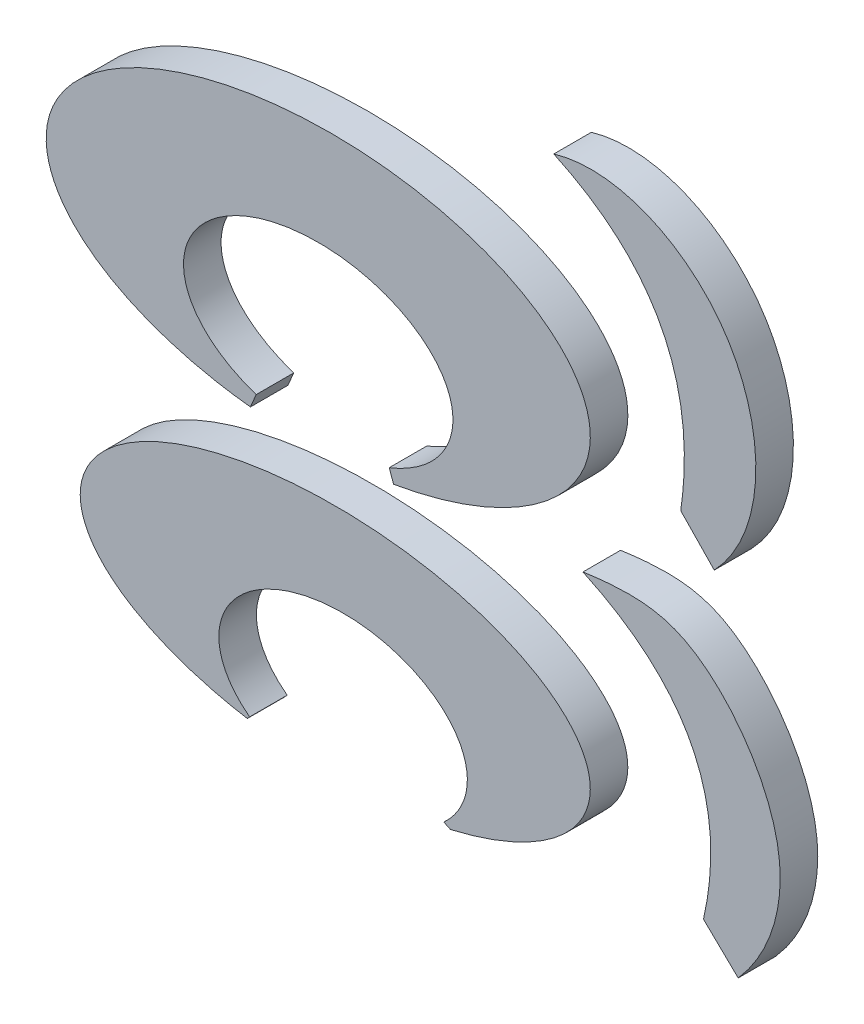
ISO-10303-21;
HEADER;
FILE_DESCRIPTION(('STEP AP214'),'2;1');
FILE_NAME('part.step','',(''),(''),'','','');
FILE_SCHEMA(('AUTOMOTIVE_DESIGN { 1 0 10303 214 1 1 1 1 }'));
ENDSEC;
DATA;
#1=APPLICATION_CONTEXT('core data for automotive mechanical design processes');
#2=APPLICATION_PROTOCOL_DEFINITION('international standard','automotive_design',2000,#1);
#3=PRODUCT_CONTEXT('',#1,'mechanical');
#4=PRODUCT('Part','Part','',(#3));
#5=PRODUCT_RELATED_PRODUCT_CATEGORY('part','',(#4));
#6=PRODUCT_DEFINITION_FORMATION('','',#4);
#7=PRODUCT_DEFINITION_CONTEXT('part definition',#1,'design');
#8=PRODUCT_DEFINITION('design','',#6,#7);
#9=PRODUCT_DEFINITION_SHAPE('','',#8);
#10=(LENGTH_UNIT() NAMED_UNIT(*) SI_UNIT(.MILLI.,.METRE.));
#11=(NAMED_UNIT(*) PLANE_ANGLE_UNIT() SI_UNIT($,.RADIAN.));
#12=(NAMED_UNIT(*) SI_UNIT($,.STERADIAN.) SOLID_ANGLE_UNIT());
#13=UNCERTAINTY_MEASURE_WITH_UNIT(LENGTH_MEASURE(1.E-05),#10,'distance_accuracy_value','');
#14=(GEOMETRIC_REPRESENTATION_CONTEXT(3) GLOBAL_UNCERTAINTY_ASSIGNED_CONTEXT((#13)) GLOBAL_UNIT_ASSIGNED_CONTEXT((#10,
#11,#12)) REPRESENTATION_CONTEXT('',''));
#15=CARTESIAN_POINT('',(0.,0.,0.));
#16=DIRECTION('',(0.,0.,1.));
#17=DIRECTION('',(1.,0.,0.));
#18=AXIS2_PLACEMENT_3D('',#15,#16,#17);
#19=CARTESIAN_POINT('',(-11.6760120303204,0.,1.27));
#20=CARTESIAN_POINT('',(-6.32002457464684,-2.48532700289628,1.27));
#21=CARTESIAN_POINT('',(-7.60000246084615,-8.13388628506801,1.27));
#22=B_SPLINE_CURVE_WITH_KNOTS('',2,(#19,#20,#21),.UNSPECIFIED.,.F.,.F.,(3,3),(0.,1.),.UNSPECIFIED.);
#23=DIRECTION('',(0.,0.,-1.));
#24=VECTOR('',#23,1.);
#25=SURFACE_OF_LINEAR_EXTRUSION('',#22,#24);
#26=CARTESIAN_POINT('',(-11.6760120303204,0.,0.));
#27=CARTESIAN_POINT('',(-6.32002457464684,-2.48532700289628,0.));
#28=CARTESIAN_POINT('',(-7.60000246084615,-8.13388628506801,0.));
#29=B_SPLINE_CURVE_WITH_KNOTS('',2,(#26,#27,#28),.UNSPECIFIED.,.F.,.F.,(3,3),(0.,1.),.UNSPECIFIED.);
#30=CARTESIAN_POINT('',(-11.6760120303204,0.,0.));
#31=VERTEX_POINT('',#30);
#32=CARTESIAN_POINT('',(-7.60000246084615,-8.13388628506801,0.));
#33=VERTEX_POINT('',#32);
#34=EDGE_CURVE('E90',#31,#33,#29,.T.);
#35=ORIENTED_EDGE('',*,*,#34,.T.);
#36=DIRECTION('',(0.,0.,-1.));
#37=VECTOR('',#36,1.);
#38=CARTESIAN_POINT('',(-7.60000246084615,-8.13388628506801,1.27));
#39=LINE('',#38,#37);
#40=CARTESIAN_POINT('',(-7.60000246084615,-8.13388628506801,1.27));
#41=VERTEX_POINT('',#40);
#42=EDGE_CURVE('E12',#41,#33,#39,.T.);
#43=ORIENTED_EDGE('',*,*,#42,.F.);
#44=CARTESIAN_POINT('',(-11.6760120303204,0.,1.27));
#45=VERTEX_POINT('',#44);
#46=EDGE_CURVE('E84',#45,#41,#22,.T.);
#47=ORIENTED_EDGE('',*,*,#46,.F.);
#48=DIRECTION('',(0.,0.,-1.));
#49=VECTOR('',#48,1.);
#50=CARTESIAN_POINT('',(-11.6760120303204,0.,1.27));
#51=LINE('',#50,#49);
#52=EDGE_CURVE('E91',#45,#31,#51,.T.);
#53=ORIENTED_EDGE('',*,*,#52,.T.);
#54=EDGE_LOOP('',(#35,#43,#47,#53));
#55=FACE_BOUND('',#54,.T.);
#56=ADVANCED_FACE('F43',(#55),#25,.F.);
#57=CARTESIAN_POINT('',(-7.60000246084615,-8.13388628506801,1.27));
#58=DIRECTION('',(0.694594513699569,0.719401460617408,0.));
#59=DIRECTION('',(-0.719401460617408,0.694594513699569,0.));
#60=AXIS2_PLACEMENT_3D('',#57,#58,#59);
#61=PLANE('',#60);
#62=DIRECTION('',(0.719401460617408,-0.694594513699568,0.));
#63=VECTOR('',#62,1.);
#64=CARTESIAN_POINT('',(-7.60000246084615,-8.13388628506801,0.));
#65=LINE('',#64,#63);
#66=CARTESIAN_POINT('',(-6.42553744876375,-9.26785250363035,0.));
#67=VERTEX_POINT('',#66);
#68=EDGE_CURVE('E72',#33,#67,#65,.T.);
#69=ORIENTED_EDGE('',*,*,#68,.T.);
#70=DIRECTION('',(0.,0.,-1.));
#71=VECTOR('',#70,1.);
#72=CARTESIAN_POINT('',(-6.42553744876375,-9.26785250363035,1.27));
#73=LINE('',#72,#71);
#74=CARTESIAN_POINT('',(-6.42553744876375,-9.26785250363035,1.27));
#75=VERTEX_POINT('',#74);
#76=EDGE_CURVE('E52',#75,#67,#73,.T.);
#77=ORIENTED_EDGE('',*,*,#76,.F.);
#78=DIRECTION('',(0.719401460617408,-0.694594513699568,0.));
#79=VECTOR('',#78,1.);
#80=CARTESIAN_POINT('',(-7.60000246084615,-8.13388628506801,1.27));
#81=LINE('',#80,#79);
#82=EDGE_CURVE('E80',#41,#75,#81,.T.);
#83=ORIENTED_EDGE('',*,*,#82,.F.);
#84=ORIENTED_EDGE('',*,*,#42,.T.);
#85=EDGE_LOOP('',(#69,#77,#83,#84));
#86=FACE_BOUND('',#85,.T.);
#87=ADVANCED_FACE('F81',(#86),#61,.F.);
#88=CARTESIAN_POINT('',(-6.42553744876375,-9.26785250363035,1.27));
#89=CARTESIAN_POINT('',(-5.39629074361934,-8.10547327527175,1.27));
#90=CARTESIAN_POINT('',(-4.1962481251043,-4.74753912687896,1.27));
#91=CARTESIAN_POINT('',(-7.45811660243791,-0.0306947817792168,1.27));
#92=CARTESIAN_POINT('',(-9.83703415051635,0.2641120682248,1.27));
#93=CARTESIAN_POINT('',(-11.6760120303204,0.,1.27));
#94=B_SPLINE_CURVE_WITH_KNOTS('',3,(#88,#89,#90,#91,#92,#93),.UNSPECIFIED.,.F.,.F.,(4,1,1,4),
(0.,0.335432414125384,0.721969328304386,1.),.UNSPECIFIED.);
#95=DIRECTION('',(0.,0.,-1.));
#96=VECTOR('',#95,1.);
#97=SURFACE_OF_LINEAR_EXTRUSION('',#94,#96);
#98=CARTESIAN_POINT('',(-6.42553744876375,-9.26785250363035,0.));
#99=CARTESIAN_POINT('',(-5.39629074361934,-8.10547327527175,0.));
#100=CARTESIAN_POINT('',(-4.1962481251043,-4.74753912687896,0.));
#101=CARTESIAN_POINT('',(-7.45811660243791,-0.0306947817792168,0.));
#102=CARTESIAN_POINT('',(-9.83703415051635,0.2641120682248,0.));
#103=CARTESIAN_POINT('',(-11.6760120303204,0.,0.));
#104=B_SPLINE_CURVE_WITH_KNOTS('',3,(#98,#99,#100,#101,#102,#103),.UNSPECIFIED.,.F.,.F.,(4,1,1,
4),(0.,0.335432414125384,0.721969328304386,1.),.UNSPECIFIED.);
#105=EDGE_CURVE('E77',#67,#31,#104,.T.);
#106=ORIENTED_EDGE('',*,*,#105,.T.);
#107=ORIENTED_EDGE('',*,*,#52,.F.);
#108=EDGE_CURVE('E60',#75,#45,#94,.T.);
#109=ORIENTED_EDGE('',*,*,#108,.F.);
#110=ORIENTED_EDGE('',*,*,#76,.T.);
#111=EDGE_LOOP('',(#106,#107,#109,#110));
#112=FACE_BOUND('',#111,.T.);
#113=ADVANCED_FACE('F111',(#112),#97,.F.);
#114=CARTESIAN_POINT('',(-7.97901591011506,-3.27613507271514,1.27));
#115=DIRECTION('',(0.,0.,1.));
#116=DIRECTION('',(1.,0.,0.));
#117=AXIS2_PLACEMENT_3D('',#114,#115,#116);
#118=PLANE('',#117);
#119=ORIENTED_EDGE('',*,*,#46,.T.);
#120=ORIENTED_EDGE('',*,*,#82,.T.);
#121=ORIENTED_EDGE('',*,*,#108,.T.);
#122=EDGE_LOOP('',(#119,#120,#121));
#123=FACE_BOUND('',#122,.T.);
#124=ADVANCED_FACE('F87',(#123),#118,.T.);
#125=CARTESIAN_POINT('',(-7.97901591011506,-3.27613507271514,0.));
#126=DIRECTION('',(0.,0.,1.));
#127=DIRECTION('',(1.,0.,0.));
#128=AXIS2_PLACEMENT_3D('',#125,#126,#127);
#129=PLANE('',#128);
#130=ORIENTED_EDGE('',*,*,#34,.F.);
#131=ORIENTED_EDGE('',*,*,#105,.F.);
#132=ORIENTED_EDGE('',*,*,#68,.F.);
#133=EDGE_LOOP('',(#130,#131,#132));
#134=FACE_BOUND('',#133,.T.);
#135=ADVANCED_FACE('F112',(#134),#129,.F.);
#136=CLOSED_SHELL('',(#56,#87,#113,#124,#135));
#137=MANIFOLD_SOLID_BREP('B2',#136);
#138=CARTESIAN_POINT('',(-12.6623516508566,11.7510213332929,1.27));
#139=CARTESIAN_POINT('',(-7.5124311845587,9.35549839923511,1.27));
#140=CARTESIAN_POINT('',(-8.36947953772774,3.4487686616758,1.27));
#141=B_SPLINE_CURVE_WITH_KNOTS('',2,(#138,#139,#140),.UNSPECIFIED.,.F.,.F.,(3,3),(0.,1.),.UNSPECIFIED.);
#142=DIRECTION('',(0.,0.,-1.));
#143=VECTOR('',#142,1.);
#144=SURFACE_OF_LINEAR_EXTRUSION('',#141,#143);
#145=CARTESIAN_POINT('',(-12.6623516508566,11.7510213332929,0.));
#146=CARTESIAN_POINT('',(-7.5124311845587,9.35549839923511,0.));
#147=CARTESIAN_POINT('',(-8.36947953772774,3.4487686616758,0.));
#148=B_SPLINE_CURVE_WITH_KNOTS('',2,(#145,#146,#147),.UNSPECIFIED.,.F.,.F.,(3,3),(0.,1.),.UNSPECIFIED.);
#149=CARTESIAN_POINT('',(-12.6623516508566,11.7510213332929,0.));
#150=VERTEX_POINT('',#149);
#151=CARTESIAN_POINT('',(-8.36947953772774,3.4487686616758,0.));
#152=VERTEX_POINT('',#151);
#153=EDGE_CURVE('E219',#150,#152,#148,.T.);
#154=ORIENTED_EDGE('',*,*,#153,.T.);
#155=DIRECTION('',(0.,0.,-1.));
#156=VECTOR('',#155,1.);
#157=CARTESIAN_POINT('',(-8.36947953772774,3.4487686616758,1.27));
#158=LINE('',#157,#156);
#159=CARTESIAN_POINT('',(-8.36947953772774,3.4487686616758,1.27));
#160=VERTEX_POINT('',#159);
#161=EDGE_CURVE('E41',#160,#152,#158,.T.);
#162=ORIENTED_EDGE('',*,*,#161,.F.);
#163=CARTESIAN_POINT('',(-12.6623516508566,11.7510213332929,1.27));
#164=VERTEX_POINT('',#163);
#165=EDGE_CURVE('E213',#164,#160,#141,.T.);
#166=ORIENTED_EDGE('',*,*,#165,.F.);
#167=DIRECTION('',(0.,0.,-1.));
#168=VECTOR('',#167,1.);
#169=CARTESIAN_POINT('',(-12.6623516508566,11.7510213332929,1.27));
#170=LINE('',#169,#168);
#171=EDGE_CURVE('E220',#164,#150,#170,.T.);
#172=ORIENTED_EDGE('',*,*,#171,.T.);
#173=EDGE_LOOP('',(#154,#162,#166,#172));
#174=FACE_BOUND('',#173,.T.);
#175=ADVANCED_FACE('F172',(#174),#144,.F.);
#176=CARTESIAN_POINT('',(-8.36947953772774,3.4487686616758,1.27));
#177=DIRECTION('',(0.71940146061741,0.694594513699566,0.));
#178=DIRECTION('',(-0.694594513699566,0.71940146061741,0.));
#179=AXIS2_PLACEMENT_3D('',#176,#177,#178);
#180=PLANE('',#179);
#181=DIRECTION('',(0.694594513699566,-0.71940146061741,0.));
#182=VECTOR('',#181,1.);
#183=CARTESIAN_POINT('',(-8.36947953772774,3.4487686616758,0.));
#184=LINE('',#183,#182);
#185=CARTESIAN_POINT('',(-7.23551331916541,2.27430364959339,0.));
#186=VERTEX_POINT('',#185);
#187=EDGE_CURVE('E201',#152,#186,#184,.T.);
#188=ORIENTED_EDGE('',*,*,#187,.T.);
#189=DIRECTION('',(0.,0.,-1.));
#190=VECTOR('',#189,1.);
#191=CARTESIAN_POINT('',(-7.23551331916541,2.27430364959339,1.27));
#192=LINE('',#191,#190);
#193=CARTESIAN_POINT('',(-7.23551331916541,2.27430364959339,1.27));
#194=VERTEX_POINT('',#193);
#195=EDGE_CURVE('E181',#194,#186,#192,.T.);
#196=ORIENTED_EDGE('',*,*,#195,.F.);
#197=DIRECTION('',(0.694594513699566,-0.71940146061741,0.));
#198=VECTOR('',#197,1.);
#199=CARTESIAN_POINT('',(-8.36947953772774,3.4487686616758,1.27));
#200=LINE('',#199,#198);
#201=EDGE_CURVE('E209',#160,#194,#200,.T.);
#202=ORIENTED_EDGE('',*,*,#201,.F.);
#203=ORIENTED_EDGE('',*,*,#161,.T.);
#204=EDGE_LOOP('',(#188,#196,#202,#203));
#205=FACE_BOUND('',#204,.T.);
#206=ADVANCED_FACE('F210',(#205),#180,.F.);
#207=CARTESIAN_POINT('',(-7.23551331916541,2.27430364959339,1.27));
#208=CARTESIAN_POINT('',(-5.33394076577673,4.2680237941255,1.27));
#209=CARTESIAN_POINT('',(-5.51959442390804,10.132577175806,1.27));
#210=CARTESIAN_POINT('',(-10.6129078707292,12.3584934138826,1.27));
#211=CARTESIAN_POINT('',(-12.6623516508566,11.7510213332929,1.27));
#212=B_SPLINE_CURVE_WITH_KNOTS('',3,(#207,#208,#209,#210,#211),.UNSPECIFIED.,.F.,.F.,(4,1,4),
(0.,0.55873810738589,1.),.UNSPECIFIED.);
#213=DIRECTION('',(0.,0.,-1.));
#214=VECTOR('',#213,1.);
#215=SURFACE_OF_LINEAR_EXTRUSION('',#212,#214);
#216=CARTESIAN_POINT('',(-7.23551331916541,2.27430364959339,0.));
#217=CARTESIAN_POINT('',(-5.33394076577673,4.2680237941255,0.));
#218=CARTESIAN_POINT('',(-5.51959442390804,10.132577175806,0.));
#219=CARTESIAN_POINT('',(-10.6129078707292,12.3584934138826,0.));
#220=CARTESIAN_POINT('',(-12.6623516508566,11.7510213332929,0.));
#221=B_SPLINE_CURVE_WITH_KNOTS('',3,(#216,#217,#218,#219,#220),.UNSPECIFIED.,.F.,.F.,(4,1,4),
(0.,0.55873810738589,1.),.UNSPECIFIED.);
#222=EDGE_CURVE('E206',#186,#150,#221,.T.);
#223=ORIENTED_EDGE('',*,*,#222,.T.);
#224=ORIENTED_EDGE('',*,*,#171,.F.);
#225=EDGE_CURVE('E189',#194,#164,#212,.T.);
#226=ORIENTED_EDGE('',*,*,#225,.F.);
#227=ORIENTED_EDGE('',*,*,#195,.T.);
#228=EDGE_LOOP('',(#223,#224,#226,#227));
#229=FACE_BOUND('',#228,.T.);
#230=ADVANCED_FACE('F240',(#229),#215,.F.);
#231=CARTESIAN_POINT('',(-9.01417338942543,8.47769669835972,1.27));
#232=DIRECTION('',(0.,0.,1.));
#233=DIRECTION('',(1.,0.,0.));
#234=AXIS2_PLACEMENT_3D('',#231,#232,#233);
#235=PLANE('',#234);
#236=ORIENTED_EDGE('',*,*,#165,.T.);
#237=ORIENTED_EDGE('',*,*,#201,.T.);
#238=ORIENTED_EDGE('',*,*,#225,.T.);
#239=EDGE_LOOP('',(#236,#237,#238));
#240=FACE_BOUND('',#239,.T.);
#241=ADVANCED_FACE('F216',(#240),#235,.T.);
#242=CARTESIAN_POINT('',(-9.01417338942543,8.47769669835972,0.));
#243=DIRECTION('',(0.,0.,1.));
#244=DIRECTION('',(1.,0.,0.));
#245=AXIS2_PLACEMENT_3D('',#242,#243,#244);
#246=PLANE('',#245);
#247=ORIENTED_EDGE('',*,*,#153,.F.);
#248=ORIENTED_EDGE('',*,*,#222,.F.);
#249=ORIENTED_EDGE('',*,*,#187,.F.);
#250=EDGE_LOOP('',(#247,#248,#249));
#251=FACE_BOUND('',#250,.T.);
#252=ADVANCED_FACE('F241',(#251),#246,.F.);
#253=CLOSED_SHELL('',(#175,#206,#230,#241,#252));
#254=MANIFOLD_SOLID_BREP('B6',#253);
#255=CARTESIAN_POINT('',(-19.7893590433034,-8.04664858103662,1.27));
#256=DIRECTION('',(0.,0.,-1.));
#257=DIRECTION('',(1.,0.,0.));
#258=AXIS2_PLACEMENT_3D('',#255,#256,#257);
#259=ELLIPSE('',#258,4.20224714489791,2.7867533697744);
#260=DIRECTION('',(0.,0.,-1.));
#261=VECTOR('',#260,1.);
#262=SURFACE_OF_LINEAR_EXTRUSION('',#259,#261);
#263=CARTESIAN_POINT('',(-19.7893590433034,-8.04664858103662,0.));
#264=DIRECTION('',(0.,0.,-1.));
#265=DIRECTION('',(1.,0.,0.));
#266=AXIS2_PLACEMENT_3D('',#263,#264,#265);
#267=ELLIPSE('',#266,4.20224714489791,2.7867533697744);
#268=CARTESIAN_POINT('',(-22.9504910555042,-9.88278483460185,0.));
#269=VERTEX_POINT('',#268);
#270=CARTESIAN_POINT('',(-16.3810518147752,-9.67676607934495,0.));
#271=VERTEX_POINT('',#270);
#272=EDGE_CURVE('E378',#269,#271,#267,.T.);
#273=ORIENTED_EDGE('',*,*,#272,.T.);
#274=DIRECTION('',(0.,0.,-1.));
#275=VECTOR('',#274,1.);
#276=CARTESIAN_POINT('',(-16.3810518147752,-9.67676607934495,1.27));
#277=LINE('',#276,#275);
#278=CARTESIAN_POINT('',(-16.3810518147752,-9.67676607934495,1.27));
#279=VERTEX_POINT('',#278);
#280=EDGE_CURVE('E170',#279,#271,#277,.T.);
#281=ORIENTED_EDGE('',*,*,#280,.F.);
#282=CARTESIAN_POINT('',(-22.9504910555042,-9.88278483460185,1.27));
#283=VERTEX_POINT('',#282);
#284=EDGE_CURVE('E352',#283,#279,#259,.T.);
#285=ORIENTED_EDGE('',*,*,#284,.F.);
#286=DIRECTION('',(0.,0.,-1.));
#287=VECTOR('',#286,1.);
#288=CARTESIAN_POINT('',(-22.9504910555042,-9.88278483460185,1.27));
#289=LINE('',#288,#287);
#290=EDGE_CURVE('E360',#283,#269,#289,.T.);
#291=ORIENTED_EDGE('',*,*,#290,.T.);
#292=EDGE_LOOP('',(#273,#281,#285,#291));
#293=FACE_BOUND('',#292,.T.);
#294=ADVANCED_FACE('F300',(#293),#262,.F.);
#295=CARTESIAN_POINT('',(-16.3810518147752,-9.67676607934495,1.27));
#296=DIRECTION('',(0.439131233320292,0.898422929317033,0.));
#297=DIRECTION('',(-0.898422929317033,0.439131233320293,0.));
#298=AXIS2_PLACEMENT_3D('',#295,#296,#297);
#299=PLANE('',#298);
#300=DIRECTION('',(0.898422929317033,-0.439131233320292,0.));
#301=VECTOR('',#300,1.);
#302=CARTESIAN_POINT('',(-16.3810518147752,-9.67676607934495,0.));
#303=LINE('',#302,#301);
#304=CARTESIAN_POINT('',(-16.1594875118865,-9.78506229754283,0.));
#305=VERTEX_POINT('',#304);
#306=EDGE_CURVE('E356',#271,#305,#303,.T.);
#307=ORIENTED_EDGE('',*,*,#306,.T.);
#308=DIRECTION('',(0.,0.,-1.));
#309=VECTOR('',#308,1.);
#310=CARTESIAN_POINT('',(-16.1594875118865,-9.78506229754283,1.27));
#311=LINE('',#310,#309);
#312=CARTESIAN_POINT('',(-16.1594875118865,-9.78506229754283,1.27));
#313=VERTEX_POINT('',#312);
#314=EDGE_CURVE('E309',#313,#305,#311,.T.);
#315=ORIENTED_EDGE('',*,*,#314,.F.);
#316=DIRECTION('',(0.898422929317033,-0.439131233320292,0.));
#317=VECTOR('',#316,1.);
#318=CARTESIAN_POINT('',(-16.3810518147752,-9.67676607934495,1.27));
#319=LINE('',#318,#317);
#320=EDGE_CURVE('E347',#279,#313,#319,.T.);
#321=ORIENTED_EDGE('',*,*,#320,.F.);
#322=ORIENTED_EDGE('',*,*,#280,.T.);
#323=EDGE_LOOP('',(#307,#315,#321,#322));
#324=FACE_BOUND('',#323,.T.);
#325=ADVANCED_FACE('F355',(#324),#299,.F.);
#326=CARTESIAN_POINT('',(-20.0547641261395,-6.2330471816604,1.27));
#327=DIRECTION('',(0.,0.,1.));
#328=DIRECTION('',(1.,0.,0.));
#329=AXIS2_PLACEMENT_3D('',#326,#327,#328);
#330=ELLIPSE('',#329,8.62566519215887,3.98107624253486);
#331=DIRECTION('',(0.,0.,-1.));
#332=VECTOR('',#331,1.);
#333=SURFACE_OF_LINEAR_EXTRUSION('',#330,#332);
#334=CARTESIAN_POINT('',(-20.0547641261395,-6.2330471816604,0.));
#335=DIRECTION('',(0.,0.,1.));
#336=DIRECTION('',(1.,0.,0.));
#337=AXIS2_PLACEMENT_3D('',#334,#335,#336);
#338=ELLIPSE('',#337,8.62566519215887,3.98107624253486);
#339=CARTESIAN_POINT('',(-23.0297305459488,-9.96984666428592,0.));
#340=VERTEX_POINT('',#339);
#341=EDGE_CURVE('E334',#305,#340,#338,.T.);
#342=ORIENTED_EDGE('',*,*,#341,.T.);
#343=DIRECTION('',(0.,0.,-1.));
#344=VECTOR('',#343,1.);
#345=CARTESIAN_POINT('',(-23.0297305459488,-9.96984666428592,1.27));
#346=LINE('',#345,#344);
#347=CARTESIAN_POINT('',(-23.0297305459488,-9.96984666428592,1.27));
#348=VERTEX_POINT('',#347);
#349=EDGE_CURVE('E357',#348,#340,#346,.T.);
#350=ORIENTED_EDGE('',*,*,#349,.F.);
#351=EDGE_CURVE('E350',#313,#348,#330,.T.);
#352=ORIENTED_EDGE('',*,*,#351,.F.);
#353=ORIENTED_EDGE('',*,*,#314,.T.);
#354=EDGE_LOOP('',(#342,#350,#352,#353));
#355=FACE_BOUND('',#354,.T.);
#356=ADVANCED_FACE('F358',(#355),#333,.F.);
#357=CARTESIAN_POINT('',(-22.9504910555042,-9.88278483460185,1.27));
#358=DIRECTION('',(-0.739549393196321,0.673102291648864,0.));
#359=DIRECTION('',(-0.673102291648864,-0.739549393196321,0.));
#360=AXIS2_PLACEMENT_3D('',#357,#358,#359);
#361=PLANE('',#360);
#362=DIRECTION('',(0.673102291648864,0.739549393196321,0.));
#363=VECTOR('',#362,1.);
#364=CARTESIAN_POINT('',(-22.9504910555042,-9.88278483460185,0.));
#365=LINE('',#364,#363);
#366=EDGE_CURVE('E340',#340,#269,#365,.T.);
#367=ORIENTED_EDGE('',*,*,#366,.T.);
#368=ORIENTED_EDGE('',*,*,#290,.F.);
#369=DIRECTION('',(0.673102291648864,0.739549393196321,0.));
#370=VECTOR('',#369,1.);
#371=CARTESIAN_POINT('',(-22.9504910555042,-9.88278483460185,1.27));
#372=LINE('',#371,#370);
#373=EDGE_CURVE('E317',#348,#283,#372,.T.);
#374=ORIENTED_EDGE('',*,*,#373,.F.);
#375=ORIENTED_EDGE('',*,*,#349,.T.);
#376=EDGE_LOOP('',(#367,#368,#374,#375));
#377=FACE_BOUND('',#376,.T.);
#378=ADVANCED_FACE('F367',(#377),#361,.F.);
#379=CARTESIAN_POINT('',(-19.7893590433034,-8.04664858103662,1.27));
#380=DIRECTION('',(0.,0.,1.));
#381=DIRECTION('',(1.,0.,0.));
#382=AXIS2_PLACEMENT_3D('',#379,#380,#381);
#383=PLANE('',#382);
#384=ORIENTED_EDGE('',*,*,#284,.T.);
#385=ORIENTED_EDGE('',*,*,#320,.T.);
#386=ORIENTED_EDGE('',*,*,#351,.T.);
#387=ORIENTED_EDGE('',*,*,#373,.T.);
#388=EDGE_LOOP('',(#384,#385,#386,#387));
#389=FACE_BOUND('',#388,.T.);
#390=ADVANCED_FACE('F348',(#389),#383,.T.);
#391=CARTESIAN_POINT('',(-19.7893590433034,-8.04664858103662,0.));
#392=DIRECTION('',(0.,0.,1.));
#393=DIRECTION('',(1.,0.,0.));
#394=AXIS2_PLACEMENT_3D('',#391,#392,#393);
#395=PLANE('',#394);
#396=ORIENTED_EDGE('',*,*,#272,.F.);
#397=ORIENTED_EDGE('',*,*,#366,.F.);
#398=ORIENTED_EDGE('',*,*,#341,.F.);
#399=ORIENTED_EDGE('',*,*,#306,.F.);
#400=EDGE_LOOP('',(#396,#397,#398,#399));
#401=FACE_BOUND('',#400,.T.);
#402=ADVANCED_FACE('F385',(#401),#395,.F.);
#403=CLOSED_SHELL('',(#294,#325,#356,#378,#390,#402));
#404=MANIFOLD_SOLID_BREP('B35',#403);
#405=CARTESIAN_POINT('',(-20.6298084722834,3.85234596609458,1.27));
#406=DIRECTION('',(0.,0.,1.));
#407=DIRECTION('',(0.999434189893676,0.0336348044675758,0.));
#408=AXIS2_PLACEMENT_3D('',#405,#406,#407);
#409=ELLIPSE('',#408,9.20591833993752,4.73335491493105);
#410=DIRECTION('',(0.,0.,-1.));
#411=VECTOR('',#410,1.);
#412=SURFACE_OF_LINEAR_EXTRUSION('',#409,#411);
#413=CARTESIAN_POINT('',(-20.6298084722834,3.85234596609458,0.));
#414=DIRECTION('',(0.,0.,1.));
#415=DIRECTION('',(0.999434189893676,0.0336348044675758,0.));
#416=AXIS2_PLACEMENT_3D('',#413,#414,#415);
#417=ELLIPSE('',#416,9.20591833993752,4.73335491493105);
#418=CARTESIAN_POINT('',(-18.0823839499285,-0.634868908051525,0.));
#419=VERTEX_POINT('',#418);
#420=CARTESIAN_POINT('',(-22.9230881040626,-0.79033170795396,0.));
#421=VERTEX_POINT('',#420);
#422=EDGE_CURVE('E503',#419,#421,#417,.T.);
#423=ORIENTED_EDGE('',*,*,#422,.T.);
#424=DIRECTION('',(0.,0.,-1.));
#425=VECTOR('',#424,1.);
#426=CARTESIAN_POINT('',(-22.9230881040626,-0.79033170795396,1.27));
#427=LINE('',#426,#425);
#428=CARTESIAN_POINT('',(-22.9230881040626,-0.79033170795396,1.27));
#429=VERTEX_POINT('',#428);
#430=EDGE_CURVE('E298',#429,#421,#427,.T.);
#431=ORIENTED_EDGE('',*,*,#430,.F.);
#432=CARTESIAN_POINT('',(-18.0823839499285,-0.634868908051525,1.27));
#433=VERTEX_POINT('',#432);
#434=EDGE_CURVE('E477',#433,#429,#409,.T.);
#435=ORIENTED_EDGE('',*,*,#434,.F.);
#436=DIRECTION('',(0.,0.,-1.));
#437=VECTOR('',#436,1.);
#438=CARTESIAN_POINT('',(-18.0823839499285,-0.634868908051525,1.27));
#439=LINE('',#438,#437);
#440=EDGE_CURVE('E485',#433,#419,#439,.T.);
#441=ORIENTED_EDGE('',*,*,#440,.T.);
#442=EDGE_LOOP('',(#423,#431,#435,#441));
#443=FACE_BOUND('',#442,.T.);
#444=ADVANCED_FACE('F425',(#443),#412,.F.);
#445=CARTESIAN_POINT('',(-22.7294725771276,-0.331045559293694,1.27));
#446=DIRECTION('',(-0.921468901120646,0.388452138966319,0.));
#447=DIRECTION('',(-0.388452138966319,-0.921468901120646,0.));
#448=AXIS2_PLACEMENT_3D('',#445,#446,#447);
#449=PLANE('',#448);
#450=DIRECTION('',(0.388452138966319,0.921468901120646,0.));
#451=VECTOR('',#450,1.);
#452=CARTESIAN_POINT('',(-22.7294725771276,-0.331045559293694,0.));
#453=LINE('',#452,#451);
#454=CARTESIAN_POINT('',(-22.7294725771276,-0.331045559293694,0.));
#455=VERTEX_POINT('',#454);
#456=EDGE_CURVE('E481',#421,#455,#453,.T.);
#457=ORIENTED_EDGE('',*,*,#456,.T.);
#458=DIRECTION('',(0.,0.,-1.));
#459=VECTOR('',#458,1.);
#460=CARTESIAN_POINT('',(-22.7294725771276,-0.331045559293694,1.27));
#461=LINE('',#460,#459);
#462=CARTESIAN_POINT('',(-22.7294725771276,-0.331045559293694,1.27));
#463=VERTEX_POINT('',#462);
#464=EDGE_CURVE('E434',#463,#455,#461,.T.);
#465=ORIENTED_EDGE('',*,*,#464,.F.);
#466=DIRECTION('',(0.388452138966319,0.921468901120646,0.));
#467=VECTOR('',#466,1.);
#468=CARTESIAN_POINT('',(-22.7294725771276,-0.331045559293694,1.27));
#469=LINE('',#468,#467);
#470=EDGE_CURVE('E472',#429,#463,#469,.T.);
#471=ORIENTED_EDGE('',*,*,#470,.F.);
#472=ORIENTED_EDGE('',*,*,#430,.T.);
#473=EDGE_LOOP('',(#457,#465,#471,#472));
#474=FACE_BOUND('',#473,.T.);
#475=ADVANCED_FACE('F480',(#474),#449,.F.);
#476=CARTESIAN_POINT('',(-20.6298084722834,2.25991546908064,1.27));
#477=DIRECTION('',(0.,0.,-1.));
#478=DIRECTION('',(1.,0.,0.));
#479=AXIS2_PLACEMENT_3D('',#476,#477,#478);
#480=ELLIPSE('',#479,4.55612058867878,2.91945591119223);
#481=DIRECTION('',(0.,0.,-1.));
#482=VECTOR('',#481,1.);
#483=SURFACE_OF_LINEAR_EXTRUSION('',#480,#482);
#484=CARTESIAN_POINT('',(-20.6298084722834,2.25991546908064,0.));
#485=DIRECTION('',(0.,0.,-1.));
#486=DIRECTION('',(1.,0.,0.));
#487=AXIS2_PLACEMENT_3D('',#484,#485,#486);
#488=ELLIPSE('',#487,4.55612058867878,2.91945591119223);
#489=CARTESIAN_POINT('',(-18.2278220560258,-0.220866733689143,0.));
#490=VERTEX_POINT('',#489);
#491=EDGE_CURVE('E459',#455,#490,#488,.T.);
#492=ORIENTED_EDGE('',*,*,#491,.T.);
#493=DIRECTION('',(0.,0.,-1.));
#494=VECTOR('',#493,1.);
#495=CARTESIAN_POINT('',(-18.2278220560258,-0.220866733689143,1.27));
#496=LINE('',#495,#494);
#497=CARTESIAN_POINT('',(-18.2278220560258,-0.220866733689143,1.27));
#498=VERTEX_POINT('',#497);
#499=EDGE_CURVE('E482',#498,#490,#496,.T.);
#500=ORIENTED_EDGE('',*,*,#499,.F.);
#501=EDGE_CURVE('E475',#463,#498,#480,.T.);
#502=ORIENTED_EDGE('',*,*,#501,.F.);
#503=ORIENTED_EDGE('',*,*,#464,.T.);
#504=EDGE_LOOP('',(#492,#500,#502,#503));
#505=FACE_BOUND('',#504,.T.);
#506=ADVANCED_FACE('F483',(#505),#483,.F.);
#507=CARTESIAN_POINT('',(-18.2278220560258,-0.220866733689143,1.27));
#508=DIRECTION('',(0.943475901972773,0.33144112960926,0.));
#509=DIRECTION('',(-0.33144112960926,0.943475901972773,0.));
#510=AXIS2_PLACEMENT_3D('',#507,#508,#509);
#511=PLANE('',#510);
#512=DIRECTION('',(0.33144112960926,-0.943475901972773,0.));
#513=VECTOR('',#512,1.);
#514=CARTESIAN_POINT('',(-18.2278220560258,-0.220866733689143,0.));
#515=LINE('',#514,#513);
#516=EDGE_CURVE('E465',#490,#419,#515,.T.);
#517=ORIENTED_EDGE('',*,*,#516,.T.);
#518=ORIENTED_EDGE('',*,*,#440,.F.);
#519=DIRECTION('',(0.33144112960926,-0.943475901972773,0.));
#520=VECTOR('',#519,1.);
#521=CARTESIAN_POINT('',(-18.2278220560258,-0.220866733689143,1.27));
#522=LINE('',#521,#520);
#523=EDGE_CURVE('E442',#498,#433,#522,.T.);
#524=ORIENTED_EDGE('',*,*,#523,.F.);
#525=ORIENTED_EDGE('',*,*,#499,.T.);
#526=EDGE_LOOP('',(#517,#518,#524,#525));
#527=FACE_BOUND('',#526,.T.);
#528=ADVANCED_FACE('F492',(#527),#511,.F.);
#529=CARTESIAN_POINT('',(-20.6298084722834,3.85234596609458,1.27));
#530=DIRECTION('',(0.,0.,1.));
#531=DIRECTION('',(1.,0.,0.));
#532=AXIS2_PLACEMENT_3D('',#529,#530,#531);
#533=PLANE('',#532);
#534=ORIENTED_EDGE('',*,*,#434,.T.);
#535=ORIENTED_EDGE('',*,*,#470,.T.);
#536=ORIENTED_EDGE('',*,*,#501,.T.);
#537=ORIENTED_EDGE('',*,*,#523,.T.);
#538=EDGE_LOOP('',(#534,#535,#536,#537));
#539=FACE_BOUND('',#538,.T.);
#540=ADVANCED_FACE('F473',(#539),#533,.T.);
#541=CARTESIAN_POINT('',(-20.6298084722834,3.85234596609458,0.));
#542=DIRECTION('',(0.,0.,1.));
#543=DIRECTION('',(1.,0.,0.));
#544=AXIS2_PLACEMENT_3D('',#541,#542,#543);
#545=PLANE('',#544);
#546=ORIENTED_EDGE('',*,*,#422,.F.);
#547=ORIENTED_EDGE('',*,*,#516,.F.);
#548=ORIENTED_EDGE('',*,*,#491,.F.);
#549=ORIENTED_EDGE('',*,*,#456,.F.);
#550=EDGE_LOOP('',(#546,#547,#548,#549));
#551=FACE_BOUND('',#550,.T.);
#552=ADVANCED_FACE('F510',(#551),#545,.F.);
#553=CLOSED_SHELL('',(#444,#475,#506,#528,#540,#552));
#554=MANIFOLD_SOLID_BREP('B164',#553);
#555=ADVANCED_BREP_SHAPE_REPRESENTATION('',(#18,#137,#254,#404,#554),#14);
#556=SHAPE_DEFINITION_REPRESENTATION(#9,#555);
ENDSEC;
END-ISO-10303-21;
